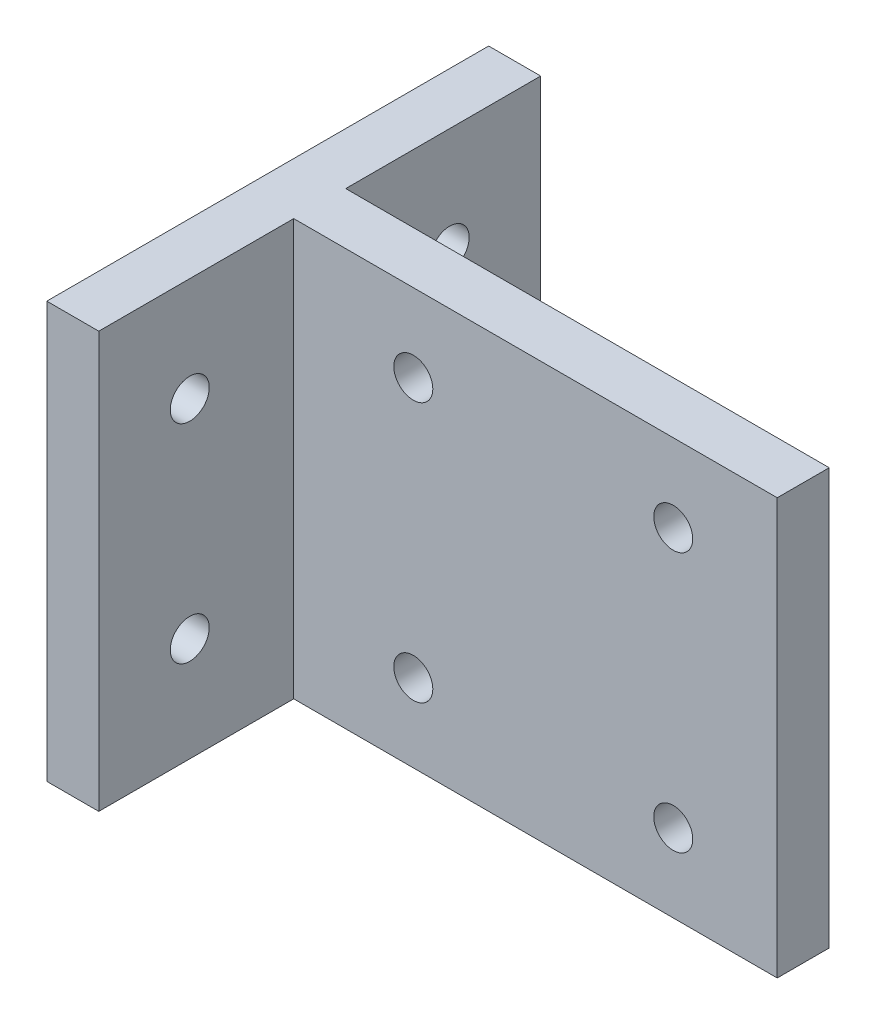
ISO-10303-21;
HEADER;
FILE_DESCRIPTION(('STEP AP214'),'2;1');
FILE_NAME('part.step','',(''),(''),'','','');
FILE_SCHEMA(('AUTOMOTIVE_DESIGN { 1 0 10303 214 1 1 1 1 }'));
ENDSEC;
DATA;
#1=APPLICATION_CONTEXT('core data for automotive mechanical design processes');
#2=APPLICATION_PROTOCOL_DEFINITION('international standard','automotive_design',2000,#1);
#3=PRODUCT_CONTEXT('',#1,'mechanical');
#4=PRODUCT('Part','Part','',(#3));
#5=PRODUCT_RELATED_PRODUCT_CATEGORY('part','',(#4));
#6=PRODUCT_DEFINITION_FORMATION('','',#4);
#7=PRODUCT_DEFINITION_CONTEXT('part definition',#1,'design');
#8=PRODUCT_DEFINITION('design','',#6,#7);
#9=PRODUCT_DEFINITION_SHAPE('','',#8);
#10=(LENGTH_UNIT() NAMED_UNIT(*) SI_UNIT(.MILLI.,.METRE.));
#11=(NAMED_UNIT(*) PLANE_ANGLE_UNIT() SI_UNIT($,.RADIAN.));
#12=(NAMED_UNIT(*) SI_UNIT($,.STERADIAN.) SOLID_ANGLE_UNIT());
#13=UNCERTAINTY_MEASURE_WITH_UNIT(LENGTH_MEASURE(1.E-05),#10,'distance_accuracy_value','');
#14=(GEOMETRIC_REPRESENTATION_CONTEXT(3) GLOBAL_UNCERTAINTY_ASSIGNED_CONTEXT((#13)) GLOBAL_UNIT_ASSIGNED_CONTEXT((#10,
#11,#12)) REPRESENTATION_CONTEXT('',''));
#15=CARTESIAN_POINT('',(0.,0.,0.));
#16=DIRECTION('',(0.,0.,1.));
#17=DIRECTION('',(1.,0.,0.));
#18=AXIS2_PLACEMENT_3D('',#15,#16,#17);
#19=CARTESIAN_POINT('',(0.,0.,4.));
#20=DIRECTION('',(0.,0.,-1.));
#21=DIRECTION('',(-1.,0.,0.));
#22=AXIS2_PLACEMENT_3D('',#19,#20,#21);
#23=PLANE('',#22);
#24=DIRECTION('',(-1.,0.,0.));
#25=VECTOR('',#24,1.);
#26=CARTESIAN_POINT('',(0.,32.,4.));
#27=LINE('',#26,#25);
#28=CARTESIAN_POINT('',(36.,32.,4.));
#29=VERTEX_POINT('',#28);
#30=CARTESIAN_POINT('',(-1.20000000000001,32.,4.));
#31=VERTEX_POINT('',#30);
#32=EDGE_CURVE('E183',#29,#31,#27,.T.);
#33=ORIENTED_EDGE('',*,*,#32,.T.);
#34=DIRECTION('',(0.,1.,0.));
#35=VECTOR('',#34,1.);
#36=CARTESIAN_POINT('',(-1.2,-34.3953485227291,4.));
#37=LINE('',#36,#35);
#38=CARTESIAN_POINT('',(-1.2,0.,4.));
#39=VERTEX_POINT('',#38);
#40=EDGE_CURVE('E146',#39,#31,#37,.T.);
#41=ORIENTED_EDGE('',*,*,#40,.F.);
#42=DIRECTION('',(1.,0.,0.));
#43=VECTOR('',#42,1.);
#44=CARTESIAN_POINT('',(0.,0.,4.));
#45=LINE('',#44,#43);
#46=CARTESIAN_POINT('',(36.,0.,4.));
#47=VERTEX_POINT('',#46);
#48=EDGE_CURVE('E113',#39,#47,#45,.T.);
#49=ORIENTED_EDGE('',*,*,#48,.T.);
#50=DIRECTION('',(0.,1.,0.));
#51=VECTOR('',#50,1.);
#52=CARTESIAN_POINT('',(36.,0.,4.));
#53=LINE('',#52,#51);
#54=EDGE_CURVE('E52',#47,#29,#53,.T.);
#55=ORIENTED_EDGE('',*,*,#54,.T.);
#56=EDGE_LOOP('',(#33,#41,#49,#55));
#57=FACE_BOUND('',#56,.T.);
#58=CARTESIAN_POINT('',(7.99999999999999,26.,4.));
#59=DIRECTION('',(0.,0.,1.));
#60=DIRECTION('',(1.,0.,0.));
#61=AXIS2_PLACEMENT_3D('',#58,#59,#60);
#62=CIRCLE('',#61,1.5);
#63=CARTESIAN_POINT('',(9.49999999999999,26.,4.));
#64=VERTEX_POINT('',#63);
#65=EDGE_CURVE('E176',#64,#64,#62,.T.);
#66=ORIENTED_EDGE('',*,*,#65,.F.);
#67=EDGE_LOOP('',(#66));
#68=FACE_BOUND('',#67,.T.);
#69=CARTESIAN_POINT('',(28.,26.,4.));
#70=DIRECTION('',(0.,0.,1.));
#71=DIRECTION('',(1.,0.,0.));
#72=AXIS2_PLACEMENT_3D('',#69,#70,#71);
#73=CIRCLE('',#72,1.5);
#74=CARTESIAN_POINT('',(29.5,26.,4.));
#75=VERTEX_POINT('',#74);
#76=EDGE_CURVE('E170',#75,#75,#73,.T.);
#77=ORIENTED_EDGE('',*,*,#76,.F.);
#78=EDGE_LOOP('',(#77));
#79=FACE_BOUND('',#78,.T.);
#80=CARTESIAN_POINT('',(8.,6.,4.));
#81=DIRECTION('',(0.,0.,1.));
#82=DIRECTION('',(1.,0.,0.));
#83=AXIS2_PLACEMENT_3D('',#80,#81,#82);
#84=CIRCLE('',#83,1.5);
#85=CARTESIAN_POINT('',(9.5,6.,4.));
#86=VERTEX_POINT('',#85);
#87=EDGE_CURVE('E164',#86,#86,#84,.T.);
#88=ORIENTED_EDGE('',*,*,#87,.F.);
#89=EDGE_LOOP('',(#88));
#90=FACE_BOUND('',#89,.T.);
#91=CARTESIAN_POINT('',(28.,6.00000000000001,4.));
#92=DIRECTION('',(0.,0.,1.));
#93=DIRECTION('',(1.,0.,0.));
#94=AXIS2_PLACEMENT_3D('',#91,#92,#93);
#95=CIRCLE('',#94,1.5);
#96=CARTESIAN_POINT('',(29.5,6.00000000000001,4.));
#97=VERTEX_POINT('',#96);
#98=EDGE_CURVE('E157',#97,#97,#95,.T.);
#99=ORIENTED_EDGE('',*,*,#98,.F.);
#100=EDGE_LOOP('',(#99));
#101=FACE_BOUND('',#100,.T.);
#102=ADVANCED_FACE('F35',(#57,#68,#79,#90,#101),#23,.F.);
#103=CARTESIAN_POINT('',(0.,0.,0.));
#104=DIRECTION('',(0.,0.,-1.));
#105=DIRECTION('',(-1.,0.,0.));
#106=AXIS2_PLACEMENT_3D('',#103,#104,#105);
#107=PLANE('',#106);
#108=CARTESIAN_POINT('',(8.,6.,0.));
#109=DIRECTION('',(0.,0.,1.));
#110=DIRECTION('',(1.,0.,0.));
#111=AXIS2_PLACEMENT_3D('',#108,#109,#110);
#112=CIRCLE('',#111,1.5);
#113=CARTESIAN_POINT('',(9.5,6.,0.));
#114=VERTEX_POINT('',#113);
#115=EDGE_CURVE('E160',#114,#114,#112,.T.);
#116=ORIENTED_EDGE('',*,*,#115,.T.);
#117=EDGE_LOOP('',(#116));
#118=FACE_BOUND('',#117,.T.);
#119=CARTESIAN_POINT('',(7.99999999999999,26.,0.));
#120=DIRECTION('',(0.,0.,1.));
#121=DIRECTION('',(1.,0.,0.));
#122=AXIS2_PLACEMENT_3D('',#119,#120,#121);
#123=CIRCLE('',#122,1.5);
#124=CARTESIAN_POINT('',(9.49999999999999,26.,0.));
#125=VERTEX_POINT('',#124);
#126=EDGE_CURVE('E173',#125,#125,#123,.T.);
#127=ORIENTED_EDGE('',*,*,#126,.T.);
#128=EDGE_LOOP('',(#127));
#129=FACE_BOUND('',#128,.T.);
#130=DIRECTION('',(1.,0.,0.));
#131=VECTOR('',#130,1.);
#132=CARTESIAN_POINT('',(0.,0.,0.));
#133=LINE('',#132,#131);
#134=CARTESIAN_POINT('',(-1.2,0.,0.));
#135=VERTEX_POINT('',#134);
#136=CARTESIAN_POINT('',(36.,0.,0.));
#137=VERTEX_POINT('',#136);
#138=EDGE_CURVE('E63',#135,#137,#133,.T.);
#139=ORIENTED_EDGE('',*,*,#138,.F.);
#140=DIRECTION('',(0.,1.,0.));
#141=VECTOR('',#140,1.);
#142=CARTESIAN_POINT('',(-1.2,-34.3953485227291,0.));
#143=LINE('',#142,#141);
#144=CARTESIAN_POINT('',(-1.20000000000001,32.,0.));
#145=VERTEX_POINT('',#144);
#146=EDGE_CURVE('E117',#135,#145,#143,.T.);
#147=ORIENTED_EDGE('',*,*,#146,.T.);
#148=DIRECTION('',(-1.,0.,0.));
#149=VECTOR('',#148,1.);
#150=CARTESIAN_POINT('',(0.,32.,0.));
#151=LINE('',#150,#149);
#152=CARTESIAN_POINT('',(36.,32.,0.));
#153=VERTEX_POINT('',#152);
#154=EDGE_CURVE('E104',#153,#145,#151,.T.);
#155=ORIENTED_EDGE('',*,*,#154,.F.);
#156=DIRECTION('',(0.,1.,0.));
#157=VECTOR('',#156,1.);
#158=CARTESIAN_POINT('',(36.,0.,0.));
#159=LINE('',#158,#157);
#160=EDGE_CURVE('E114',#137,#153,#159,.T.);
#161=ORIENTED_EDGE('',*,*,#160,.F.);
#162=EDGE_LOOP('',(#139,#147,#155,#161));
#163=FACE_BOUND('',#162,.T.);
#164=CARTESIAN_POINT('',(28.,26.,0.));
#165=DIRECTION('',(0.,0.,1.));
#166=DIRECTION('',(1.,0.,0.));
#167=AXIS2_PLACEMENT_3D('',#164,#165,#166);
#168=CIRCLE('',#167,1.5);
#169=CARTESIAN_POINT('',(29.5,26.,0.));
#170=VERTEX_POINT('',#169);
#171=EDGE_CURVE('E167',#170,#170,#168,.T.);
#172=ORIENTED_EDGE('',*,*,#171,.T.);
#173=EDGE_LOOP('',(#172));
#174=FACE_BOUND('',#173,.T.);
#175=CARTESIAN_POINT('',(28.,6.00000000000001,0.));
#176=DIRECTION('',(0.,0.,1.));
#177=DIRECTION('',(1.,0.,0.));
#178=AXIS2_PLACEMENT_3D('',#175,#176,#177);
#179=CIRCLE('',#178,1.5);
#180=CARTESIAN_POINT('',(29.5,6.00000000000001,0.));
#181=VERTEX_POINT('',#180);
#182=EDGE_CURVE('E161',#181,#181,#179,.T.);
#183=ORIENTED_EDGE('',*,*,#182,.T.);
#184=EDGE_LOOP('',(#183));
#185=FACE_BOUND('',#184,.T.);
#186=ADVANCED_FACE('F118',(#118,#129,#163,#174,#185),#107,.T.);
#187=CARTESIAN_POINT('',(0.,0.,4.));
#188=DIRECTION('',(0.,1.,0.));
#189=DIRECTION('',(-1.,0.,0.));
#190=AXIS2_PLACEMENT_3D('',#187,#188,#189);
#191=PLANE('',#190);
#192=ORIENTED_EDGE('',*,*,#138,.T.);
#193=DIRECTION('',(0.,0.,-1.));
#194=VECTOR('',#193,1.);
#195=CARTESIAN_POINT('',(36.,0.,4.));
#196=LINE('',#195,#194);
#197=EDGE_CURVE('E11',#47,#137,#196,.T.);
#198=ORIENTED_EDGE('',*,*,#197,.F.);
#199=ORIENTED_EDGE('',*,*,#48,.F.);
#200=DIRECTION('',(0.,0.,1.));
#201=VECTOR('',#200,1.);
#202=CARTESIAN_POINT('',(-1.2,0.,4.));
#203=LINE('',#202,#201);
#204=CARTESIAN_POINT('',(-1.19999999999999,0.,19.));
#205=VERTEX_POINT('',#204);
#206=EDGE_CURVE('E136',#39,#205,#203,.T.);
#207=ORIENTED_EDGE('',*,*,#206,.T.);
#208=DIRECTION('',(-1.,0.,0.));
#209=VECTOR('',#208,1.);
#210=CARTESIAN_POINT('',(-1.2,0.,19.));
#211=LINE('',#210,#209);
#212=CARTESIAN_POINT('',(-5.2,0.,19.));
#213=VERTEX_POINT('',#212);
#214=EDGE_CURVE('E195',#205,#213,#211,.T.);
#215=ORIENTED_EDGE('',*,*,#214,.T.);
#216=DIRECTION('',(0.,0.,-1.));
#217=VECTOR('',#216,1.);
#218=CARTESIAN_POINT('',(-5.2,0.,19.));
#219=LINE('',#218,#217);
#220=CARTESIAN_POINT('',(-5.20000000000001,0.,-15.));
#221=VERTEX_POINT('',#220);
#222=EDGE_CURVE('E203',#213,#221,#219,.T.);
#223=ORIENTED_EDGE('',*,*,#222,.T.);
#224=DIRECTION('',(1.,0.,0.));
#225=VECTOR('',#224,1.);
#226=CARTESIAN_POINT('',(-5.2,0.,-15.));
#227=LINE('',#226,#225);
#228=CARTESIAN_POINT('',(-1.2,0.,-15.));
#229=VERTEX_POINT('',#228);
#230=EDGE_CURVE('E69',#221,#229,#227,.T.);
#231=ORIENTED_EDGE('',*,*,#230,.T.);
#232=DIRECTION('',(0.,0.,1.));
#233=VECTOR('',#232,1.);
#234=CARTESIAN_POINT('',(-1.2,0.,0.));
#235=LINE('',#234,#233);
#236=EDGE_CURVE('E149',#229,#135,#235,.T.);
#237=ORIENTED_EDGE('',*,*,#236,.T.);
#238=EDGE_LOOP('',(#192,#198,#199,#207,#215,#223,#231,#237));
#239=FACE_BOUND('',#238,.T.);
#240=ADVANCED_FACE('F37',(#239),#191,.F.);
#241=CARTESIAN_POINT('',(36.,0.,4.));
#242=DIRECTION('',(-1.,0.,0.));
#243=DIRECTION('',(0.,-1.,0.));
#244=AXIS2_PLACEMENT_3D('',#241,#242,#243);
#245=PLANE('',#244);
#246=ORIENTED_EDGE('',*,*,#160,.T.);
#247=DIRECTION('',(0.,0.,-1.));
#248=VECTOR('',#247,1.);
#249=CARTESIAN_POINT('',(36.,32.,4.));
#250=LINE('',#249,#248);
#251=EDGE_CURVE('E44',#29,#153,#250,.T.);
#252=ORIENTED_EDGE('',*,*,#251,.F.);
#253=ORIENTED_EDGE('',*,*,#54,.F.);
#254=ORIENTED_EDGE('',*,*,#197,.T.);
#255=EDGE_LOOP('',(#246,#252,#253,#254));
#256=FACE_BOUND('',#255,.T.);
#257=ADVANCED_FACE('F187',(#256),#245,.F.);
#258=CARTESIAN_POINT('',(0.,32.,4.));
#259=DIRECTION('',(0.,-1.,0.));
#260=DIRECTION('',(1.,0.,0.));
#261=AXIS2_PLACEMENT_3D('',#258,#259,#260);
#262=PLANE('',#261);
#263=ORIENTED_EDGE('',*,*,#154,.T.);
#264=DIRECTION('',(0.,0.,-1.));
#265=VECTOR('',#264,1.);
#266=CARTESIAN_POINT('',(-1.20000000000001,32.,0.));
#267=LINE('',#266,#265);
#268=CARTESIAN_POINT('',(-1.20000000000001,32.,-15.));
#269=VERTEX_POINT('',#268);
#270=EDGE_CURVE('E109',#145,#269,#267,.T.);
#271=ORIENTED_EDGE('',*,*,#270,.T.);
#272=DIRECTION('',(-1.,0.,0.));
#273=VECTOR('',#272,1.);
#274=CARTESIAN_POINT('',(-5.20000000000001,32.,-15.));
#275=LINE('',#274,#273);
#276=CARTESIAN_POINT('',(-5.20000000000001,32.,-15.));
#277=VERTEX_POINT('',#276);
#278=EDGE_CURVE('E127',#269,#277,#275,.T.);
#279=ORIENTED_EDGE('',*,*,#278,.T.);
#280=DIRECTION('',(0.,0.,1.));
#281=VECTOR('',#280,1.);
#282=CARTESIAN_POINT('',(-5.20000000000001,32.,19.));
#283=LINE('',#282,#281);
#284=CARTESIAN_POINT('',(-5.20000000000001,32.,19.));
#285=VERTEX_POINT('',#284);
#286=EDGE_CURVE('E130',#277,#285,#283,.T.);
#287=ORIENTED_EDGE('',*,*,#286,.T.);
#288=DIRECTION('',(1.,0.,0.));
#289=VECTOR('',#288,1.);
#290=CARTESIAN_POINT('',(-1.20000000000001,32.,19.));
#291=LINE('',#290,#289);
#292=CARTESIAN_POINT('',(-1.20000000000001,32.,19.));
#293=VERTEX_POINT('',#292);
#294=EDGE_CURVE('E141',#285,#293,#291,.T.);
#295=ORIENTED_EDGE('',*,*,#294,.T.);
#296=DIRECTION('',(0.,0.,-1.));
#297=VECTOR('',#296,1.);
#298=CARTESIAN_POINT('',(-1.20000000000001,32.,4.));
#299=LINE('',#298,#297);
#300=EDGE_CURVE('E122',#293,#31,#299,.T.);
#301=ORIENTED_EDGE('',*,*,#300,.T.);
#302=ORIENTED_EDGE('',*,*,#32,.F.);
#303=ORIENTED_EDGE('',*,*,#251,.T.);
#304=EDGE_LOOP('',(#263,#271,#279,#287,#295,#301,#302,#303));
#305=FACE_BOUND('',#304,.T.);
#306=ADVANCED_FACE('F106',(#305),#262,.F.);
#307=CARTESIAN_POINT('',(7.99999999999999,26.,4.));
#308=DIRECTION('',(0.,0.,-1.));
#309=DIRECTION('',(-1.,0.,0.));
#310=AXIS2_PLACEMENT_3D('',#307,#308,#309);
#311=CYLINDRICAL_SURFACE('',#310,1.5);
#312=ORIENTED_EDGE('',*,*,#65,.T.);
#313=EDGE_LOOP('',(#312));
#314=FACE_BOUND('',#313,.T.);
#315=ORIENTED_EDGE('',*,*,#126,.F.);
#316=EDGE_LOOP('',(#315));
#317=FACE_BOUND('',#316,.T.);
#318=ADVANCED_FACE('F264',(#314,#317),#311,.F.);
#319=CARTESIAN_POINT('',(28.,26.,4.));
#320=DIRECTION('',(0.,0.,-1.));
#321=DIRECTION('',(-1.,0.,0.));
#322=AXIS2_PLACEMENT_3D('',#319,#320,#321);
#323=CYLINDRICAL_SURFACE('',#322,1.5);
#324=ORIENTED_EDGE('',*,*,#76,.T.);
#325=EDGE_LOOP('',(#324));
#326=FACE_BOUND('',#325,.T.);
#327=ORIENTED_EDGE('',*,*,#171,.F.);
#328=EDGE_LOOP('',(#327));
#329=FACE_BOUND('',#328,.T.);
#330=ADVANCED_FACE('F304',(#326,#329),#323,.F.);
#331=CARTESIAN_POINT('',(8.,6.,4.));
#332=DIRECTION('',(0.,0.,-1.));
#333=DIRECTION('',(-1.,0.,0.));
#334=AXIS2_PLACEMENT_3D('',#331,#332,#333);
#335=CYLINDRICAL_SURFACE('',#334,1.5);
#336=ORIENTED_EDGE('',*,*,#87,.T.);
#337=EDGE_LOOP('',(#336));
#338=FACE_BOUND('',#337,.T.);
#339=ORIENTED_EDGE('',*,*,#115,.F.);
#340=EDGE_LOOP('',(#339));
#341=FACE_BOUND('',#340,.T.);
#342=ADVANCED_FACE('F294',(#338,#341),#335,.F.);
#343=CARTESIAN_POINT('',(28.,6.00000000000001,4.));
#344=DIRECTION('',(0.,0.,-1.));
#345=DIRECTION('',(-1.,0.,0.));
#346=AXIS2_PLACEMENT_3D('',#343,#344,#345);
#347=CYLINDRICAL_SURFACE('',#346,1.5);
#348=ORIENTED_EDGE('',*,*,#98,.T.);
#349=EDGE_LOOP('',(#348));
#350=FACE_BOUND('',#349,.T.);
#351=ORIENTED_EDGE('',*,*,#182,.F.);
#352=EDGE_LOOP('',(#351));
#353=FACE_BOUND('',#352,.T.);
#354=ADVANCED_FACE('F241',(#350,#353),#347,.F.);
#355=CARTESIAN_POINT('',(-1.2,-34.3953485227291,4.));
#356=DIRECTION('',(1.,0.,0.));
#357=DIRECTION('',(0.,1.,0.));
#358=AXIS2_PLACEMENT_3D('',#355,#356,#357);
#359=PLANE('',#358);
#360=CARTESIAN_POINT('',(-1.20000000000001,24.,12.));
#361=DIRECTION('',(1.,0.,0.));
#362=DIRECTION('',(0.,1.,0.));
#363=AXIS2_PLACEMENT_3D('',#360,#361,#362);
#364=CIRCLE('',#363,1.5);
#365=CARTESIAN_POINT('',(-1.20000000000001,25.5,12.));
#366=VERTEX_POINT('',#365);
#367=EDGE_CURVE('E223',#366,#366,#364,.T.);
#368=ORIENTED_EDGE('',*,*,#367,.F.);
#369=EDGE_LOOP('',(#368));
#370=FACE_BOUND('',#369,.T.);
#371=CARTESIAN_POINT('',(-1.2,8.,12.));
#372=DIRECTION('',(1.,0.,0.));
#373=DIRECTION('',(0.,1.,0.));
#374=AXIS2_PLACEMENT_3D('',#371,#372,#373);
#375=CIRCLE('',#374,1.5);
#376=CARTESIAN_POINT('',(-1.2,9.5,12.));
#377=VERTEX_POINT('',#376);
#378=EDGE_CURVE('E217',#377,#377,#375,.T.);
#379=ORIENTED_EDGE('',*,*,#378,.F.);
#380=EDGE_LOOP('',(#379));
#381=FACE_BOUND('',#380,.T.);
#382=ORIENTED_EDGE('',*,*,#206,.F.);
#383=ORIENTED_EDGE('',*,*,#40,.T.);
#384=ORIENTED_EDGE('',*,*,#300,.F.);
#385=DIRECTION('',(0.,1.,0.));
#386=VECTOR('',#385,1.);
#387=CARTESIAN_POINT('',(-1.19999999999999,-34.3953485227291,19.));
#388=LINE('',#387,#386);
#389=EDGE_CURVE('E150',#205,#293,#388,.T.);
#390=ORIENTED_EDGE('',*,*,#389,.F.);
#391=EDGE_LOOP('',(#382,#383,#384,#390));
#392=FACE_BOUND('',#391,.T.);
#393=ADVANCED_FACE('F193',(#370,#381,#392),#359,.T.);
#394=CARTESIAN_POINT('',(-1.19999999999999,-34.3953485227291,19.));
#395=DIRECTION('',(0.,0.,1.));
#396=DIRECTION('',(1.,0.,0.));
#397=AXIS2_PLACEMENT_3D('',#394,#395,#396);
#398=PLANE('',#397);
#399=ORIENTED_EDGE('',*,*,#214,.F.);
#400=ORIENTED_EDGE('',*,*,#389,.T.);
#401=ORIENTED_EDGE('',*,*,#294,.F.);
#402=DIRECTION('',(0.,1.,0.));
#403=VECTOR('',#402,1.);
#404=CARTESIAN_POINT('',(-5.2,-34.3953485227291,19.));
#405=LINE('',#404,#403);
#406=EDGE_CURVE('E152',#213,#285,#405,.T.);
#407=ORIENTED_EDGE('',*,*,#406,.F.);
#408=EDGE_LOOP('',(#399,#400,#401,#407));
#409=FACE_BOUND('',#408,.T.);
#410=ADVANCED_FACE('F201',(#409),#398,.T.);
#411=CARTESIAN_POINT('',(-5.2,-34.3953485227291,19.));
#412=DIRECTION('',(-1.,0.,0.));
#413=DIRECTION('',(0.,-1.,0.));
#414=AXIS2_PLACEMENT_3D('',#411,#412,#413);
#415=PLANE('',#414);
#416=CARTESIAN_POINT('',(-5.20000000000002,24.,12.));
#417=DIRECTION('',(1.,0.,0.));
#418=DIRECTION('',(0.,1.,0.));
#419=AXIS2_PLACEMENT_3D('',#416,#417,#418);
#420=CIRCLE('',#419,1.5);
#421=CARTESIAN_POINT('',(-5.20000000000002,25.5,12.));
#422=VERTEX_POINT('',#421);
#423=EDGE_CURVE('E220',#422,#422,#420,.T.);
#424=ORIENTED_EDGE('',*,*,#423,.T.);
#425=EDGE_LOOP('',(#424));
#426=FACE_BOUND('',#425,.T.);
#427=CARTESIAN_POINT('',(-5.20000000000001,8.,12.));
#428=DIRECTION('',(1.,0.,0.));
#429=DIRECTION('',(0.,1.,0.));
#430=AXIS2_PLACEMENT_3D('',#427,#428,#429);
#431=CIRCLE('',#430,1.5);
#432=CARTESIAN_POINT('',(-5.20000000000001,9.5,12.));
#433=VERTEX_POINT('',#432);
#434=EDGE_CURVE('E214',#433,#433,#431,.T.);
#435=ORIENTED_EDGE('',*,*,#434,.T.);
#436=EDGE_LOOP('',(#435));
#437=FACE_BOUND('',#436,.T.);
#438=CARTESIAN_POINT('',(-5.20000000000001,8.,-8.00000000000001));
#439=DIRECTION('',(1.,0.,0.));
#440=DIRECTION('',(0.,1.,0.));
#441=AXIS2_PLACEMENT_3D('',#438,#439,#440);
#442=CIRCLE('',#441,1.5);
#443=CARTESIAN_POINT('',(-5.20000000000001,9.5,-8.00000000000001));
#444=VERTEX_POINT('',#443);
#445=EDGE_CURVE('E209',#444,#444,#442,.T.);
#446=ORIENTED_EDGE('',*,*,#445,.T.);
#447=EDGE_LOOP('',(#446));
#448=FACE_BOUND('',#447,.T.);
#449=CARTESIAN_POINT('',(-5.20000000000002,24.,-8.));
#450=DIRECTION('',(1.,0.,0.));
#451=DIRECTION('',(0.,1.,0.));
#452=AXIS2_PLACEMENT_3D('',#449,#450,#451);
#453=CIRCLE('',#452,1.5);
#454=CARTESIAN_POINT('',(-5.20000000000002,25.5,-8.));
#455=VERTEX_POINT('',#454);
#456=EDGE_CURVE('E128',#455,#455,#453,.T.);
#457=ORIENTED_EDGE('',*,*,#456,.T.);
#458=EDGE_LOOP('',(#457));
#459=FACE_BOUND('',#458,.T.);
#460=ORIENTED_EDGE('',*,*,#222,.F.);
#461=ORIENTED_EDGE('',*,*,#406,.T.);
#462=ORIENTED_EDGE('',*,*,#286,.F.);
#463=DIRECTION('',(0.,1.,0.));
#464=VECTOR('',#463,1.);
#465=CARTESIAN_POINT('',(-5.2,-34.3953485227291,-15.));
#466=LINE('',#465,#464);
#467=EDGE_CURVE('E154',#221,#277,#466,.T.);
#468=ORIENTED_EDGE('',*,*,#467,.F.);
#469=EDGE_LOOP('',(#460,#461,#462,#468));
#470=FACE_BOUND('',#469,.T.);
#471=ADVANCED_FACE('F229',(#426,#437,#448,#459,#470),#415,.T.);
#472=CARTESIAN_POINT('',(-5.2,-34.3953485227291,-15.));
#473=DIRECTION('',(0.,0.,-1.));
#474=DIRECTION('',(-1.,0.,0.));
#475=AXIS2_PLACEMENT_3D('',#472,#473,#474);
#476=PLANE('',#475);
#477=ORIENTED_EDGE('',*,*,#230,.F.);
#478=ORIENTED_EDGE('',*,*,#467,.T.);
#479=ORIENTED_EDGE('',*,*,#278,.F.);
#480=DIRECTION('',(0.,1.,0.));
#481=VECTOR('',#480,1.);
#482=CARTESIAN_POINT('',(-1.2,-34.3953485227291,-15.));
#483=LINE('',#482,#481);
#484=EDGE_CURVE('E121',#229,#269,#483,.T.);
#485=ORIENTED_EDGE('',*,*,#484,.F.);
#486=EDGE_LOOP('',(#477,#478,#479,#485));
#487=FACE_BOUND('',#486,.T.);
#488=ADVANCED_FACE('F360',(#487),#476,.T.);
#489=CARTESIAN_POINT('',(-1.2,-34.3953485227291,0.));
#490=DIRECTION('',(1.,0.,0.));
#491=DIRECTION('',(0.,1.,0.));
#492=AXIS2_PLACEMENT_3D('',#489,#490,#491);
#493=PLANE('',#492);
#494=CARTESIAN_POINT('',(-1.20000000000001,8.,-8.00000000000001));
#495=DIRECTION('',(1.,0.,0.));
#496=DIRECTION('',(0.,1.,0.));
#497=AXIS2_PLACEMENT_3D('',#494,#495,#496);
#498=CIRCLE('',#497,1.5);
#499=CARTESIAN_POINT('',(-1.20000000000001,9.5,-8.00000000000001));
#500=VERTEX_POINT('',#499);
#501=EDGE_CURVE('E211',#500,#500,#498,.T.);
#502=ORIENTED_EDGE('',*,*,#501,.F.);
#503=EDGE_LOOP('',(#502));
#504=FACE_BOUND('',#503,.T.);
#505=CARTESIAN_POINT('',(-1.20000000000001,24.,-8.));
#506=DIRECTION('',(1.,0.,0.));
#507=DIRECTION('',(0.,1.,0.));
#508=AXIS2_PLACEMENT_3D('',#505,#506,#507);
#509=CIRCLE('',#508,1.5);
#510=CARTESIAN_POINT('',(-1.20000000000001,25.5,-8.));
#511=VERTEX_POINT('',#510);
#512=EDGE_CURVE('E133',#511,#511,#509,.T.);
#513=ORIENTED_EDGE('',*,*,#512,.F.);
#514=EDGE_LOOP('',(#513));
#515=FACE_BOUND('',#514,.T.);
#516=ORIENTED_EDGE('',*,*,#236,.F.);
#517=ORIENTED_EDGE('',*,*,#484,.T.);
#518=ORIENTED_EDGE('',*,*,#270,.F.);
#519=ORIENTED_EDGE('',*,*,#146,.F.);
#520=EDGE_LOOP('',(#516,#517,#518,#519));
#521=FACE_BOUND('',#520,.T.);
#522=ADVANCED_FACE('F124',(#504,#515,#521),#493,.T.);
#523=CARTESIAN_POINT('',(-5.20000000000002,24.,-8.));
#524=DIRECTION('',(1.,0.,0.));
#525=DIRECTION('',(0.,1.,0.));
#526=AXIS2_PLACEMENT_3D('',#523,#524,#525);
#527=CYLINDRICAL_SURFACE('',#526,1.5);
#528=ORIENTED_EDGE('',*,*,#456,.F.);
#529=EDGE_LOOP('',(#528));
#530=FACE_BOUND('',#529,.T.);
#531=ORIENTED_EDGE('',*,*,#512,.T.);
#532=EDGE_LOOP('',(#531));
#533=FACE_BOUND('',#532,.T.);
#534=ADVANCED_FACE('F252',(#530,#533),#527,.F.);
#535=CARTESIAN_POINT('',(-5.20000000000001,8.,-8.00000000000001));
#536=DIRECTION('',(1.,0.,0.));
#537=DIRECTION('',(0.,1.,0.));
#538=AXIS2_PLACEMENT_3D('',#535,#536,#537);
#539=CYLINDRICAL_SURFACE('',#538,1.5);
#540=ORIENTED_EDGE('',*,*,#445,.F.);
#541=EDGE_LOOP('',(#540));
#542=FACE_BOUND('',#541,.T.);
#543=ORIENTED_EDGE('',*,*,#501,.T.);
#544=EDGE_LOOP('',(#543));
#545=FACE_BOUND('',#544,.T.);
#546=ADVANCED_FACE('F246',(#542,#545),#539,.F.);
#547=CARTESIAN_POINT('',(-5.20000000000001,8.,12.));
#548=DIRECTION('',(1.,0.,0.));
#549=DIRECTION('',(0.,1.,0.));
#550=AXIS2_PLACEMENT_3D('',#547,#548,#549);
#551=CYLINDRICAL_SURFACE('',#550,1.5);
#552=ORIENTED_EDGE('',*,*,#434,.F.);
#553=EDGE_LOOP('',(#552));
#554=FACE_BOUND('',#553,.T.);
#555=ORIENTED_EDGE('',*,*,#378,.T.);
#556=EDGE_LOOP('',(#555));
#557=FACE_BOUND('',#556,.T.);
#558=ADVANCED_FACE('F235',(#554,#557),#551,.F.);
#559=CARTESIAN_POINT('',(-5.20000000000002,24.,12.));
#560=DIRECTION('',(1.,0.,0.));
#561=DIRECTION('',(0.,1.,0.));
#562=AXIS2_PLACEMENT_3D('',#559,#560,#561);
#563=CYLINDRICAL_SURFACE('',#562,1.5);
#564=ORIENTED_EDGE('',*,*,#423,.F.);
#565=EDGE_LOOP('',(#564));
#566=FACE_BOUND('',#565,.T.);
#567=ORIENTED_EDGE('',*,*,#367,.T.);
#568=EDGE_LOOP('',(#567));
#569=FACE_BOUND('',#568,.T.);
#570=ADVANCED_FACE('F232',(#566,#569),#563,.F.);
#571=CLOSED_SHELL('',(#102,#186,#240,#257,#306,#318,#330,#342,#354,#393,#410,#471,#488,#522,
#534,#546,#558,#570));
#572=MANIFOLD_SOLID_BREP('B2',#571);
#573=ADVANCED_BREP_SHAPE_REPRESENTATION('',(#18,#572),#14);
#574=SHAPE_DEFINITION_REPRESENTATION(#9,#573);
ENDSEC;
END-ISO-10303-21;
